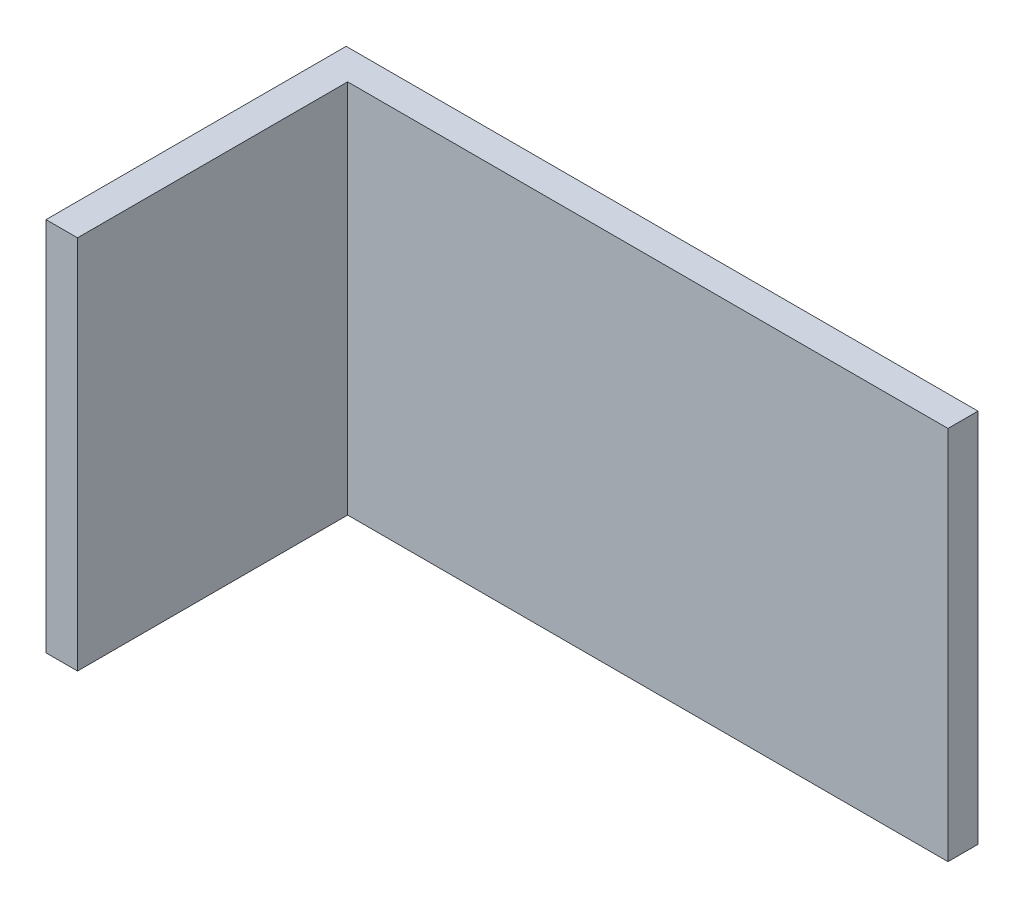
ISO-10303-21;
HEADER;
FILE_DESCRIPTION(('STEP AP214'),'2;1');
FILE_NAME('part.step','',(''),(''),'','','');
FILE_SCHEMA(('AUTOMOTIVE_DESIGN { 1 0 10303 214 1 1 1 1 }'));
ENDSEC;
DATA;
#1=APPLICATION_CONTEXT('core data for automotive mechanical design processes');
#2=APPLICATION_PROTOCOL_DEFINITION('international standard','automotive_design',2000,#1);
#3=PRODUCT_CONTEXT('',#1,'mechanical');
#4=PRODUCT('Part','Part','',(#3));
#5=PRODUCT_RELATED_PRODUCT_CATEGORY('part','',(#4));
#6=PRODUCT_DEFINITION_FORMATION('','',#4);
#7=PRODUCT_DEFINITION_CONTEXT('part definition',#1,'design');
#8=PRODUCT_DEFINITION('design','',#6,#7);
#9=PRODUCT_DEFINITION_SHAPE('','',#8);
#10=(LENGTH_UNIT() NAMED_UNIT(*) SI_UNIT(.MILLI.,.METRE.));
#11=(NAMED_UNIT(*) PLANE_ANGLE_UNIT() SI_UNIT($,.RADIAN.));
#12=(NAMED_UNIT(*) SI_UNIT($,.STERADIAN.) SOLID_ANGLE_UNIT());
#13=UNCERTAINTY_MEASURE_WITH_UNIT(LENGTH_MEASURE(1.E-05),#10,'distance_accuracy_value','');
#14=(GEOMETRIC_REPRESENTATION_CONTEXT(3) GLOBAL_UNCERTAINTY_ASSIGNED_CONTEXT((#13)) GLOBAL_UNIT_ASSIGNED_CONTEXT((#10,
#11,#12)) REPRESENTATION_CONTEXT('',''));
#15=CARTESIAN_POINT('',(0.,0.,0.));
#16=DIRECTION('',(0.,0.,1.));
#17=DIRECTION('',(1.,0.,0.));
#18=AXIS2_PLACEMENT_3D('',#15,#16,#17);
#19=CARTESIAN_POINT('',(-1.53882069959544,0.25,0.2));
#20=DIRECTION('',(0.,0.,1.));
#21=DIRECTION('',(1.,0.,0.));
#22=AXIS2_PLACEMENT_3D('',#19,#20,#21);
#23=PLANE('',#22);
#24=DIRECTION('',(0.,-1.,0.));
#25=VECTOR('',#24,1.);
#26=CARTESIAN_POINT('',(-1.54932069959544,0.25,0.2));
#27=LINE('',#26,#25);
#28=CARTESIAN_POINT('',(-1.54932069959544,0.375,0.2));
#29=VERTEX_POINT('',#28);
#30=CARTESIAN_POINT('',(-1.54932069959544,0.125,0.2));
#31=VERTEX_POINT('',#30);
#32=EDGE_CURVE('E101',#29,#31,#27,.T.);
#33=ORIENTED_EDGE('',*,*,#32,.T.);
#34=DIRECTION('',(1.,0.,0.));
#35=VECTOR('',#34,1.);
#36=CARTESIAN_POINT('',(-1.39679171408819,0.125,0.2));
#37=LINE('',#36,#35);
#38=CARTESIAN_POINT('',(-1.52832069959544,0.125,0.2));
#39=VERTEX_POINT('',#38);
#40=EDGE_CURVE('E97',#31,#39,#37,.T.);
#41=ORIENTED_EDGE('',*,*,#40,.T.);
#42=DIRECTION('',(0.,-1.,0.));
#43=VECTOR('',#42,1.);
#44=CARTESIAN_POINT('',(-1.52832069959544,0.25,0.2));
#45=LINE('',#44,#43);
#46=CARTESIAN_POINT('',(-1.52832069959544,0.375,0.2));
#47=VERTEX_POINT('',#46);
#48=EDGE_CURVE('E11',#47,#39,#45,.T.);
#49=ORIENTED_EDGE('',*,*,#48,.F.);
#50=DIRECTION('',(1.,0.,0.));
#51=VECTOR('',#50,1.);
#52=CARTESIAN_POINT('',(-1.39679171408819,0.375,0.2));
#53=LINE('',#52,#51);
#54=EDGE_CURVE('E124',#29,#47,#53,.T.);
#55=ORIENTED_EDGE('',*,*,#54,.F.);
#56=EDGE_LOOP('',(#33,#41,#49,#55));
#57=FACE_BOUND('',#56,.T.);
#58=ADVANCED_FACE('F17',(#57),#23,.T.);
#59=CARTESIAN_POINT('',(-1.52832069959544,0.25,0.11));
#60=DIRECTION('',(1.,0.,0.));
#61=DIRECTION('',(0.,0.,1.));
#62=AXIS2_PLACEMENT_3D('',#59,#60,#61);
#63=PLANE('',#62);
#64=DIRECTION('',(0.,0.,-1.));
#65=VECTOR('',#64,1.);
#66=CARTESIAN_POINT('',(-1.52832069959544,0.375,0.0420289855072459));
#67=LINE('',#66,#65);
#68=CARTESIAN_POINT('',(-1.52832069959544,0.375,0.02));
#69=VERTEX_POINT('',#68);
#70=EDGE_CURVE('E128',#47,#69,#67,.T.);
#71=ORIENTED_EDGE('',*,*,#70,.F.);
#72=ORIENTED_EDGE('',*,*,#48,.T.);
#73=DIRECTION('',(0.,0.,-1.));
#74=VECTOR('',#73,1.);
#75=CARTESIAN_POINT('',(-1.52832069959544,0.125,0.0420289855072459));
#76=LINE('',#75,#74);
#77=CARTESIAN_POINT('',(-1.52832069959544,0.125,0.02));
#78=VERTEX_POINT('',#77);
#79=EDGE_CURVE('E133',#39,#78,#76,.T.);
#80=ORIENTED_EDGE('',*,*,#79,.T.);
#81=DIRECTION('',(0.,-1.,0.));
#82=VECTOR('',#81,1.);
#83=CARTESIAN_POINT('',(-1.52832069959544,0.25,0.02));
#84=LINE('',#83,#82);
#85=EDGE_CURVE('E25',#69,#78,#84,.T.);
#86=ORIENTED_EDGE('',*,*,#85,.F.);
#87=EDGE_LOOP('',(#71,#72,#80,#86));
#88=FACE_BOUND('',#87,.T.);
#89=ADVANCED_FACE('F167',(#88),#63,.T.);
#90=CARTESIAN_POINT('',(-1.32832069959544,0.25,0.02));
#91=DIRECTION('',(0.,0.,1.));
#92=DIRECTION('',(1.,0.,0.));
#93=AXIS2_PLACEMENT_3D('',#90,#91,#92);
#94=PLANE('',#93);
#95=DIRECTION('',(1.,0.,0.));
#96=VECTOR('',#95,1.);
#97=CARTESIAN_POINT('',(-1.39679171408819,0.125,0.02));
#98=LINE('',#97,#96);
#99=CARTESIAN_POINT('',(-1.12832069959544,0.125,0.02));
#100=VERTEX_POINT('',#99);
#101=EDGE_CURVE('E154',#78,#100,#98,.T.);
#102=ORIENTED_EDGE('',*,*,#101,.T.);
#103=DIRECTION('',(0.,-1.,0.));
#104=VECTOR('',#103,1.);
#105=CARTESIAN_POINT('',(-1.12832069959544,0.25,0.02));
#106=LINE('',#105,#104);
#107=CARTESIAN_POINT('',(-1.12832069959544,0.375,0.02));
#108=VERTEX_POINT('',#107);
#109=EDGE_CURVE('E145',#108,#100,#106,.T.);
#110=ORIENTED_EDGE('',*,*,#109,.F.);
#111=DIRECTION('',(1.,0.,0.));
#112=VECTOR('',#111,1.);
#113=CARTESIAN_POINT('',(-1.39679171408819,0.375,0.02));
#114=LINE('',#113,#112);
#115=EDGE_CURVE('E146',#69,#108,#114,.T.);
#116=ORIENTED_EDGE('',*,*,#115,.F.);
#117=ORIENTED_EDGE('',*,*,#85,.T.);
#118=EDGE_LOOP('',(#102,#110,#116,#117));
#119=FACE_BOUND('',#118,.T.);
#120=ADVANCED_FACE('F165',(#119),#94,.T.);
#121=CARTESIAN_POINT('',(-1.39679171408819,0.375,0.0420289855072459));
#122=DIRECTION('',(0.,1.,0.));
#123=DIRECTION('',(1.,0.,0.));
#124=AXIS2_PLACEMENT_3D('',#121,#122,#123);
#125=PLANE('',#124);
#126=DIRECTION('',(0.,0.,1.));
#127=VECTOR('',#126,1.);
#128=CARTESIAN_POINT('',(-1.54932069959544,0.375,0.0999999999999988));
#129=LINE('',#128,#127);
#130=CARTESIAN_POINT('',(-1.54932069959544,0.375,0.));
#131=VERTEX_POINT('',#130);
#132=EDGE_CURVE('E107',#131,#29,#129,.T.);
#133=ORIENTED_EDGE('',*,*,#132,.T.);
#134=ORIENTED_EDGE('',*,*,#54,.T.);
#135=ORIENTED_EDGE('',*,*,#70,.T.);
#136=ORIENTED_EDGE('',*,*,#115,.T.);
#137=DIRECTION('',(0.,0.,1.));
#138=VECTOR('',#137,1.);
#139=CARTESIAN_POINT('',(-1.12832069959544,0.375,0.01));
#140=LINE('',#139,#138);
#141=CARTESIAN_POINT('',(-1.12832069959544,0.375,0.));
#142=VERTEX_POINT('',#141);
#143=EDGE_CURVE('E139',#142,#108,#140,.T.);
#144=ORIENTED_EDGE('',*,*,#143,.F.);
#145=DIRECTION('',(-1.,0.,0.));
#146=VECTOR('',#145,1.);
#147=CARTESIAN_POINT('',(-1.33882069959543,0.375,0.));
#148=LINE('',#147,#146);
#149=EDGE_CURVE('E112',#142,#131,#148,.T.);
#150=ORIENTED_EDGE('',*,*,#149,.T.);
#151=EDGE_LOOP('',(#133,#134,#135,#136,#144,#150));
#152=FACE_BOUND('',#151,.T.);
#153=ADVANCED_FACE('F171',(#152),#125,.T.);
#154=CARTESIAN_POINT('',(-1.54932069959544,0.25,0.0999999999999988));
#155=DIRECTION('',(1.,0.,0.));
#156=DIRECTION('',(0.,-1.,0.));
#157=AXIS2_PLACEMENT_3D('',#154,#155,#156);
#158=PLANE('',#157);
#159=DIRECTION('',(0.,-1.,0.));
#160=VECTOR('',#159,1.);
#161=CARTESIAN_POINT('',(-1.54932069959544,0.25,0.));
#162=LINE('',#161,#160);
#163=CARTESIAN_POINT('',(-1.54932069959544,0.125,0.));
#164=VERTEX_POINT('',#163);
#165=EDGE_CURVE('E104',#131,#164,#162,.T.);
#166=ORIENTED_EDGE('',*,*,#165,.T.);
#167=DIRECTION('',(0.,0.,1.));
#168=VECTOR('',#167,1.);
#169=CARTESIAN_POINT('',(-1.54932069959544,0.125,0.0420289855072459));
#170=LINE('',#169,#168);
#171=EDGE_CURVE('E89',#164,#31,#170,.T.);
#172=ORIENTED_EDGE('',*,*,#171,.T.);
#173=ORIENTED_EDGE('',*,*,#32,.F.);
#174=ORIENTED_EDGE('',*,*,#132,.F.);
#175=EDGE_LOOP('',(#166,#172,#173,#174));
#176=FACE_BOUND('',#175,.T.);
#177=ADVANCED_FACE('F105',(#176),#158,.F.);
#178=CARTESIAN_POINT('',(-1.39679171408819,0.125,0.0420289855072459));
#179=DIRECTION('',(0.,1.,0.));
#180=DIRECTION('',(0.,0.,-1.));
#181=AXIS2_PLACEMENT_3D('',#178,#179,#180);
#182=PLANE('',#181);
#183=ORIENTED_EDGE('',*,*,#101,.F.);
#184=ORIENTED_EDGE('',*,*,#79,.F.);
#185=ORIENTED_EDGE('',*,*,#40,.F.);
#186=ORIENTED_EDGE('',*,*,#171,.F.);
#187=DIRECTION('',(1.,0.,0.));
#188=VECTOR('',#187,1.);
#189=CARTESIAN_POINT('',(-1.33882069959543,0.125,0.));
#190=LINE('',#189,#188);
#191=CARTESIAN_POINT('',(-1.12832069959544,0.125,0.));
#192=VERTEX_POINT('',#191);
#193=EDGE_CURVE('E95',#164,#192,#190,.T.);
#194=ORIENTED_EDGE('',*,*,#193,.T.);
#195=DIRECTION('',(0.,0.,-1.));
#196=VECTOR('',#195,1.);
#197=CARTESIAN_POINT('',(-1.12832069959544,0.125,0.01));
#198=LINE('',#197,#196);
#199=EDGE_CURVE('E136',#100,#192,#198,.T.);
#200=ORIENTED_EDGE('',*,*,#199,.F.);
#201=EDGE_LOOP('',(#183,#184,#185,#186,#194,#200));
#202=FACE_BOUND('',#201,.T.);
#203=ADVANCED_FACE('F92',(#202),#182,.F.);
#204=CARTESIAN_POINT('',(-1.12832069959544,0.25,0.01));
#205=DIRECTION('',(1.,0.,0.));
#206=DIRECTION('',(0.,0.,-1.));
#207=AXIS2_PLACEMENT_3D('',#204,#205,#206);
#208=PLANE('',#207);
#209=ORIENTED_EDGE('',*,*,#199,.T.);
#210=DIRECTION('',(0.,1.,0.));
#211=VECTOR('',#210,1.);
#212=CARTESIAN_POINT('',(-1.12832069959544,0.25,0.));
#213=LINE('',#212,#211);
#214=EDGE_CURVE('E117',#192,#142,#213,.T.);
#215=ORIENTED_EDGE('',*,*,#214,.T.);
#216=ORIENTED_EDGE('',*,*,#143,.T.);
#217=ORIENTED_EDGE('',*,*,#109,.T.);
#218=EDGE_LOOP('',(#209,#215,#216,#217));
#219=FACE_BOUND('',#218,.T.);
#220=ADVANCED_FACE('F169',(#219),#208,.T.);
#221=CARTESIAN_POINT('',(-1.33882069959543,0.25,0.));
#222=DIRECTION('',(0.,0.,1.));
#223=DIRECTION('',(1.,0.,0.));
#224=AXIS2_PLACEMENT_3D('',#221,#222,#223);
#225=PLANE('',#224);
#226=ORIENTED_EDGE('',*,*,#193,.F.);
#227=ORIENTED_EDGE('',*,*,#165,.F.);
#228=ORIENTED_EDGE('',*,*,#149,.F.);
#229=ORIENTED_EDGE('',*,*,#214,.F.);
#230=EDGE_LOOP('',(#226,#227,#228,#229));
#231=FACE_BOUND('',#230,.T.);
#232=ADVANCED_FACE('F115',(#231),#225,.F.);
#233=CLOSED_SHELL('',(#58,#89,#120,#153,#177,#203,#220,#232));
#234=MANIFOLD_SOLID_BREP('B1',#233);
#235=ADVANCED_BREP_SHAPE_REPRESENTATION('',(#18,#234),#14);
#236=SHAPE_DEFINITION_REPRESENTATION(#9,#235);
ENDSEC;
END-ISO-10303-21;
